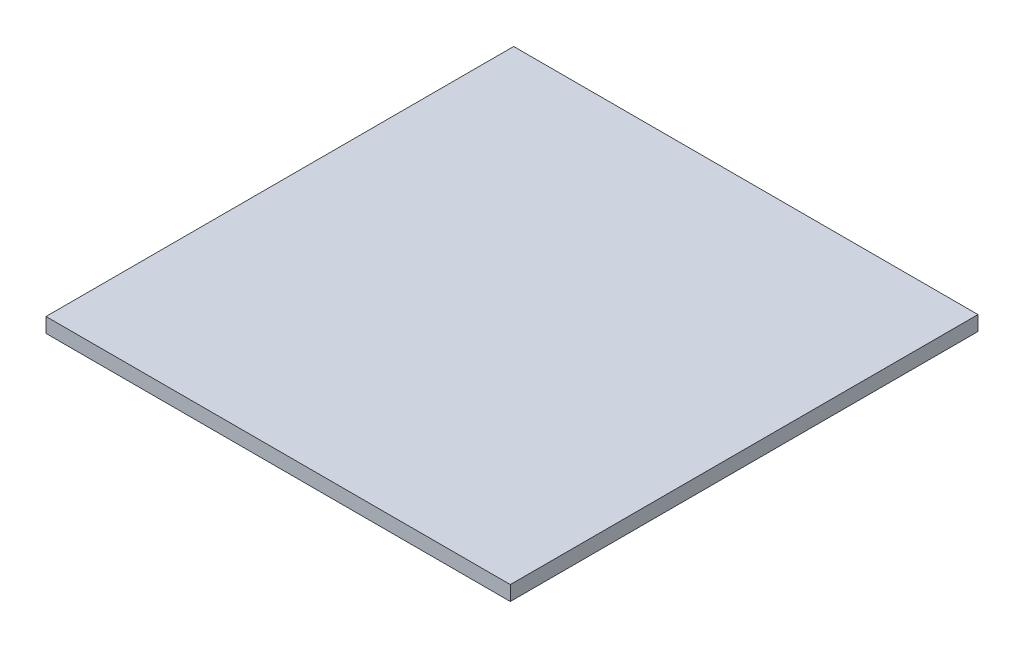
ISO-10303-21;
HEADER;
FILE_DESCRIPTION(('STEP AP214'),'2;1');
FILE_NAME('part.step','',(''),(''),'','','');
FILE_SCHEMA(('AUTOMOTIVE_DESIGN { 1 0 10303 214 1 1 1 1 }'));
ENDSEC;
DATA;
#1=APPLICATION_CONTEXT('core data for automotive mechanical design processes');
#2=APPLICATION_PROTOCOL_DEFINITION('international standard','automotive_design',2000,#1);
#3=PRODUCT_CONTEXT('',#1,'mechanical');
#4=PRODUCT('Part','Part','',(#3));
#5=PRODUCT_RELATED_PRODUCT_CATEGORY('part','',(#4));
#6=PRODUCT_DEFINITION_FORMATION('','',#4);
#7=PRODUCT_DEFINITION_CONTEXT('part definition',#1,'design');
#8=PRODUCT_DEFINITION('design','',#6,#7);
#9=PRODUCT_DEFINITION_SHAPE('','',#8);
#10=(LENGTH_UNIT() NAMED_UNIT(*) SI_UNIT(.MILLI.,.METRE.));
#11=(NAMED_UNIT(*) PLANE_ANGLE_UNIT() SI_UNIT($,.RADIAN.));
#12=(NAMED_UNIT(*) SI_UNIT($,.STERADIAN.) SOLID_ANGLE_UNIT());
#13=UNCERTAINTY_MEASURE_WITH_UNIT(LENGTH_MEASURE(1.E-05),#10,'distance_accuracy_value','');
#14=(GEOMETRIC_REPRESENTATION_CONTEXT(3) GLOBAL_UNCERTAINTY_ASSIGNED_CONTEXT((#13)) GLOBAL_UNIT_ASSIGNED_CONTEXT((#10,
#11,#12)) REPRESENTATION_CONTEXT('',''));
#15=CARTESIAN_POINT('',(0.,0.,0.));
#16=DIRECTION('',(0.,0.,1.));
#17=DIRECTION('',(1.,0.,0.));
#18=AXIS2_PLACEMENT_3D('',#15,#16,#17);
#19=CARTESIAN_POINT('',(0.,4.4,0.));
#20=DIRECTION('',(1.,0.,0.));
#21=DIRECTION('',(0.,0.,-1.));
#22=AXIS2_PLACEMENT_3D('',#19,#20,#21);
#23=PLANE('',#22);
#24=DIRECTION('',(0.,0.,1.));
#25=VECTOR('',#24,1.);
#26=CARTESIAN_POINT('',(0.,0.,0.));
#27=LINE('',#26,#25);
#28=CARTESIAN_POINT('',(0.,0.,-140.));
#29=VERTEX_POINT('',#28);
#30=CARTESIAN_POINT('',(0.,0.,0.));
#31=VERTEX_POINT('',#30);
#32=EDGE_CURVE('E96',#29,#31,#27,.T.);
#33=ORIENTED_EDGE('',*,*,#32,.T.);
#34=DIRECTION('',(0.,-1.,0.));
#35=VECTOR('',#34,1.);
#36=CARTESIAN_POINT('',(0.,4.4,0.));
#37=LINE('',#36,#35);
#38=CARTESIAN_POINT('',(0.,4.4,0.));
#39=VERTEX_POINT('',#38);
#40=EDGE_CURVE('E11',#39,#31,#37,.T.);
#41=ORIENTED_EDGE('',*,*,#40,.F.);
#42=DIRECTION('',(0.,0.,1.));
#43=VECTOR('',#42,1.);
#44=CARTESIAN_POINT('',(0.,4.4,0.));
#45=LINE('',#44,#43);
#46=CARTESIAN_POINT('',(0.,4.4,-140.));
#47=VERTEX_POINT('',#46);
#48=EDGE_CURVE('E84',#47,#39,#45,.T.);
#49=ORIENTED_EDGE('',*,*,#48,.F.);
#50=DIRECTION('',(0.,-1.,0.));
#51=VECTOR('',#50,1.);
#52=CARTESIAN_POINT('',(0.,4.4,-140.));
#53=LINE('',#52,#51);
#54=EDGE_CURVE('E92',#47,#29,#53,.T.);
#55=ORIENTED_EDGE('',*,*,#54,.T.);
#56=EDGE_LOOP('',(#33,#41,#49,#55));
#57=FACE_BOUND('',#56,.T.);
#58=ADVANCED_FACE('F33',(#57),#23,.F.);
#59=CARTESIAN_POINT('',(0.,4.4,0.));
#60=DIRECTION('',(0.,0.,-1.));
#61=DIRECTION('',(-1.,0.,0.));
#62=AXIS2_PLACEMENT_3D('',#59,#60,#61);
#63=PLANE('',#62);
#64=DIRECTION('',(1.,0.,0.));
#65=VECTOR('',#64,1.);
#66=CARTESIAN_POINT('',(0.,0.,0.));
#67=LINE('',#66,#65);
#68=CARTESIAN_POINT('',(139.,0.,0.));
#69=VERTEX_POINT('',#68);
#70=EDGE_CURVE('E88',#31,#69,#67,.T.);
#71=ORIENTED_EDGE('',*,*,#70,.T.);
#72=DIRECTION('',(0.,-1.,0.));
#73=VECTOR('',#72,1.);
#74=CARTESIAN_POINT('',(139.,4.4,0.));
#75=LINE('',#74,#73);
#76=CARTESIAN_POINT('',(139.,4.4,0.));
#77=VERTEX_POINT('',#76);
#78=EDGE_CURVE('E41',#77,#69,#75,.T.);
#79=ORIENTED_EDGE('',*,*,#78,.F.);
#80=DIRECTION('',(1.,0.,0.));
#81=VECTOR('',#80,1.);
#82=CARTESIAN_POINT('',(0.,4.4,0.));
#83=LINE('',#82,#81);
#84=EDGE_CURVE('E79',#39,#77,#83,.T.);
#85=ORIENTED_EDGE('',*,*,#84,.F.);
#86=ORIENTED_EDGE('',*,*,#40,.T.);
#87=EDGE_LOOP('',(#71,#79,#85,#86));
#88=FACE_BOUND('',#87,.T.);
#89=ADVANCED_FACE('F87',(#88),#63,.F.);
#90=CARTESIAN_POINT('',(139.,4.4,0.));
#91=DIRECTION('',(-1.,0.,0.));
#92=DIRECTION('',(0.,0.,1.));
#93=AXIS2_PLACEMENT_3D('',#90,#91,#92);
#94=PLANE('',#93);
#95=DIRECTION('',(0.,0.,-1.));
#96=VECTOR('',#95,1.);
#97=CARTESIAN_POINT('',(139.,0.,0.));
#98=LINE('',#97,#96);
#99=CARTESIAN_POINT('',(139.,0.,-140.));
#100=VERTEX_POINT('',#99);
#101=EDGE_CURVE('E66',#69,#100,#98,.T.);
#102=ORIENTED_EDGE('',*,*,#101,.T.);
#103=DIRECTION('',(0.,-1.,0.));
#104=VECTOR('',#103,1.);
#105=CARTESIAN_POINT('',(139.,4.4,-140.));
#106=LINE('',#105,#104);
#107=CARTESIAN_POINT('',(139.,4.4,-140.));
#108=VERTEX_POINT('',#107);
#109=EDGE_CURVE('E89',#108,#100,#106,.T.);
#110=ORIENTED_EDGE('',*,*,#109,.F.);
#111=DIRECTION('',(0.,0.,-1.));
#112=VECTOR('',#111,1.);
#113=CARTESIAN_POINT('',(139.,4.4,0.));
#114=LINE('',#113,#112);
#115=EDGE_CURVE('E82',#77,#108,#114,.T.);
#116=ORIENTED_EDGE('',*,*,#115,.F.);
#117=ORIENTED_EDGE('',*,*,#78,.T.);
#118=EDGE_LOOP('',(#102,#110,#116,#117));
#119=FACE_BOUND('',#118,.T.);
#120=ADVANCED_FACE('F90',(#119),#94,.F.);
#121=CARTESIAN_POINT('',(0.,4.4,-140.));
#122=DIRECTION('',(0.,0.,1.));
#123=DIRECTION('',(1.,0.,0.));
#124=AXIS2_PLACEMENT_3D('',#121,#122,#123);
#125=PLANE('',#124);
#126=DIRECTION('',(-1.,0.,0.));
#127=VECTOR('',#126,1.);
#128=CARTESIAN_POINT('',(0.,0.,-140.));
#129=LINE('',#128,#127);
#130=EDGE_CURVE('E72',#100,#29,#129,.T.);
#131=ORIENTED_EDGE('',*,*,#130,.T.);
#132=ORIENTED_EDGE('',*,*,#54,.F.);
#133=DIRECTION('',(-1.,0.,0.));
#134=VECTOR('',#133,1.);
#135=CARTESIAN_POINT('',(0.,4.4,-140.));
#136=LINE('',#135,#134);
#137=EDGE_CURVE('E49',#108,#47,#136,.T.);
#138=ORIENTED_EDGE('',*,*,#137,.F.);
#139=ORIENTED_EDGE('',*,*,#109,.T.);
#140=EDGE_LOOP('',(#131,#132,#138,#139));
#141=FACE_BOUND('',#140,.T.);
#142=ADVANCED_FACE('F103',(#141),#125,.F.);
#143=CARTESIAN_POINT('',(0.,4.4,0.));
#144=DIRECTION('',(0.,-1.,0.));
#145=DIRECTION('',(0.,0.,-1.));
#146=AXIS2_PLACEMENT_3D('',#143,#144,#145);
#147=PLANE('',#146);
#148=ORIENTED_EDGE('',*,*,#48,.T.);
#149=ORIENTED_EDGE('',*,*,#84,.T.);
#150=ORIENTED_EDGE('',*,*,#115,.T.);
#151=ORIENTED_EDGE('',*,*,#137,.T.);
#152=EDGE_LOOP('',(#148,#149,#150,#151));
#153=FACE_BOUND('',#152,.T.);
#154=ADVANCED_FACE('F80',(#153),#147,.F.);
#155=CARTESIAN_POINT('',(0.,0.,0.));
#156=DIRECTION('',(0.,-1.,0.));
#157=DIRECTION('',(0.,0.,-1.));
#158=AXIS2_PLACEMENT_3D('',#155,#156,#157);
#159=PLANE('',#158);
#160=ORIENTED_EDGE('',*,*,#32,.F.);
#161=ORIENTED_EDGE('',*,*,#130,.F.);
#162=ORIENTED_EDGE('',*,*,#101,.F.);
#163=ORIENTED_EDGE('',*,*,#70,.F.);
#164=EDGE_LOOP('',(#160,#161,#162,#163));
#165=FACE_BOUND('',#164,.T.);
#166=ADVANCED_FACE('F106',(#165),#159,.T.);
#167=CLOSED_SHELL('',(#58,#89,#120,#142,#154,#166));
#168=MANIFOLD_SOLID_BREP('B2',#167);
#169=ADVANCED_BREP_SHAPE_REPRESENTATION('',(#18,#168),#14);
#170=SHAPE_DEFINITION_REPRESENTATION(#9,#169);
ENDSEC;
END-ISO-10303-21;
